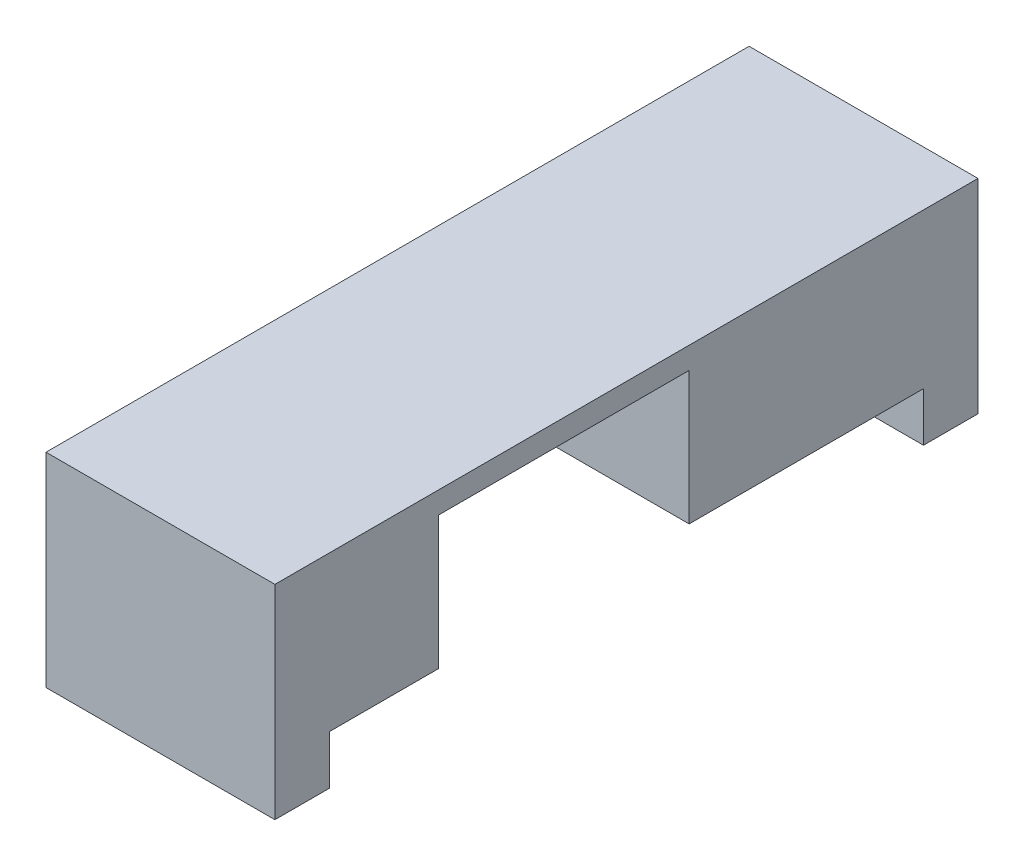
ISO-10303-21;
HEADER;
FILE_DESCRIPTION(('STEP AP214'),'2;1');
FILE_NAME('part.step','',(''),(''),'','','');
FILE_SCHEMA(('AUTOMOTIVE_DESIGN { 1 0 10303 214 1 1 1 1 }'));
ENDSEC;
DATA;
#1=APPLICATION_CONTEXT('core data for automotive mechanical design processes');
#2=APPLICATION_PROTOCOL_DEFINITION('international standard','automotive_design',2000,#1);
#3=PRODUCT_CONTEXT('',#1,'mechanical');
#4=PRODUCT('Part','Part','',(#3));
#5=PRODUCT_RELATED_PRODUCT_CATEGORY('part','',(#4));
#6=PRODUCT_DEFINITION_FORMATION('','',#4);
#7=PRODUCT_DEFINITION_CONTEXT('part definition',#1,'design');
#8=PRODUCT_DEFINITION('design','',#6,#7);
#9=PRODUCT_DEFINITION_SHAPE('','',#8);
#10=(LENGTH_UNIT() NAMED_UNIT(*) SI_UNIT(.MILLI.,.METRE.));
#11=(NAMED_UNIT(*) PLANE_ANGLE_UNIT() SI_UNIT($,.RADIAN.));
#12=(NAMED_UNIT(*) SI_UNIT($,.STERADIAN.) SOLID_ANGLE_UNIT());
#13=UNCERTAINTY_MEASURE_WITH_UNIT(LENGTH_MEASURE(1.E-05),#10,'distance_accuracy_value','');
#14=(GEOMETRIC_REPRESENTATION_CONTEXT(3) GLOBAL_UNCERTAINTY_ASSIGNED_CONTEXT((#13)) GLOBAL_UNIT_ASSIGNED_CONTEXT((#10,
#11,#12)) REPRESENTATION_CONTEXT('',''));
#15=CARTESIAN_POINT('',(0.,0.,0.));
#16=DIRECTION('',(0.,0.,1.));
#17=DIRECTION('',(1.,0.,0.));
#18=AXIS2_PLACEMENT_3D('',#15,#16,#17);
#19=CARTESIAN_POINT('',(-21.,0.,59.5));
#20=DIRECTION('',(0.,0.,1.));
#21=DIRECTION('',(1.,0.,0.));
#22=AXIS2_PLACEMENT_3D('',#19,#20,#21);
#23=PLANE('',#22);
#24=DIRECTION('',(1.,0.,0.));
#25=VECTOR('',#24,1.);
#26=CARTESIAN_POINT('',(-21.,0.,59.5));
#27=LINE('',#26,#25);
#28=CARTESIAN_POINT('',(-12.3,0.,59.5));
#29=VERTEX_POINT('',#28);
#30=CARTESIAN_POINT('',(0.,0.,59.5));
#31=VERTEX_POINT('',#30);
#32=EDGE_CURVE('E226',#29,#31,#27,.T.);
#33=ORIENTED_EDGE('',*,*,#32,.F.);
#34=DIRECTION('',(0.,-1.,0.));
#35=VECTOR('',#34,1.);
#36=CARTESIAN_POINT('',(-12.3,0.,59.5));
#37=LINE('',#36,#35);
#38=CARTESIAN_POINT('',(-12.3,4.5,59.5));
#39=VERTEX_POINT('',#38);
#40=EDGE_CURVE('E159',#39,#29,#37,.T.);
#41=ORIENTED_EDGE('',*,*,#40,.F.);
#42=DIRECTION('',(1.,0.,0.));
#43=VECTOR('',#42,1.);
#44=CARTESIAN_POINT('',(-21.,4.5,59.5));
#45=LINE('',#44,#43);
#46=CARTESIAN_POINT('',(0.,4.5,59.5));
#47=VERTEX_POINT('',#46);
#48=EDGE_CURVE('E258',#39,#47,#45,.T.);
#49=ORIENTED_EDGE('',*,*,#48,.T.);
#50=DIRECTION('',(0.,-1.,0.));
#51=VECTOR('',#50,1.);
#52=CARTESIAN_POINT('',(0.,0.,59.5));
#53=LINE('',#52,#51);
#54=EDGE_CURVE('E193',#47,#31,#53,.T.);
#55=ORIENTED_EDGE('',*,*,#54,.T.);
#56=EDGE_LOOP('',(#33,#41,#49,#55));
#57=FACE_BOUND('',#56,.T.);
#58=ADVANCED_FACE('F39',(#57),#23,.F.);
#59=CARTESIAN_POINT('',(0.,0.,0.));
#60=DIRECTION('',(0.,-1.,0.));
#61=DIRECTION('',(0.,0.,-1.));
#62=AXIS2_PLACEMENT_3D('',#59,#60,#61);
#63=PLANE('',#62);
#64=DIRECTION('',(0.,0.,-1.));
#65=VECTOR('',#64,1.);
#66=CARTESIAN_POINT('',(-12.3,0.,62.5));
#67=LINE('',#66,#65);
#68=CARTESIAN_POINT('',(-12.3,0.,62.5));
#69=VERTEX_POINT('',#68);
#70=EDGE_CURVE('E153',#69,#29,#67,.T.);
#71=ORIENTED_EDGE('',*,*,#70,.T.);
#72=ORIENTED_EDGE('',*,*,#32,.T.);
#73=DIRECTION('',(0.,0.,-1.));
#74=VECTOR('',#73,1.);
#75=CARTESIAN_POINT('',(0.,0.,0.));
#76=LINE('',#75,#74);
#77=CARTESIAN_POINT('',(0.,0.,64.5));
#78=VERTEX_POINT('',#77);
#79=EDGE_CURVE('E295',#78,#31,#76,.T.);
#80=ORIENTED_EDGE('',*,*,#79,.F.);
#81=DIRECTION('',(1.,0.,0.));
#82=VECTOR('',#81,1.);
#83=CARTESIAN_POINT('',(0.,0.,64.5));
#84=LINE('',#83,#82);
#85=CARTESIAN_POINT('',(-21.,0.,64.5));
#86=VERTEX_POINT('',#85);
#87=EDGE_CURVE('E285',#86,#78,#84,.T.);
#88=ORIENTED_EDGE('',*,*,#87,.F.);
#89=DIRECTION('',(0.,0.,1.));
#90=VECTOR('',#89,1.);
#91=CARTESIAN_POINT('',(-21.,0.,0.));
#92=LINE('',#91,#90);
#93=CARTESIAN_POINT('',(-21.,0.,59.5));
#94=VERTEX_POINT('',#93);
#95=EDGE_CURVE('E302',#94,#86,#92,.T.);
#96=ORIENTED_EDGE('',*,*,#95,.F.);
#97=CARTESIAN_POINT('',(-15.5,0.,59.5));
#98=VERTEX_POINT('',#97);
#99=EDGE_CURVE('E277',#94,#98,#27,.T.);
#100=ORIENTED_EDGE('',*,*,#99,.T.);
#101=DIRECTION('',(0.,0.,-1.));
#102=VECTOR('',#101,1.);
#103=CARTESIAN_POINT('',(-15.5,0.,62.5));
#104=LINE('',#103,#102);
#105=CARTESIAN_POINT('',(-15.5,0.,62.5));
#106=VERTEX_POINT('',#105);
#107=EDGE_CURVE('E164',#106,#98,#104,.T.);
#108=ORIENTED_EDGE('',*,*,#107,.F.);
#109=DIRECTION('',(-1.,0.,0.));
#110=VECTOR('',#109,1.);
#111=CARTESIAN_POINT('',(-12.3,0.,62.5));
#112=LINE('',#111,#110);
#113=EDGE_CURVE('E171',#69,#106,#112,.T.);
#114=ORIENTED_EDGE('',*,*,#113,.F.);
#115=EDGE_LOOP('',(#71,#72,#80,#88,#96,#100,#108,#114));
#116=FACE_BOUND('',#115,.T.);
#117=ADVANCED_FACE('F176',(#116),#63,.T.);
#118=CARTESIAN_POINT('',(0.,18.7,0.));
#119=DIRECTION('',(-1.,0.,0.));
#120=DIRECTION('',(0.,0.,1.));
#121=AXIS2_PLACEMENT_3D('',#118,#119,#120);
#122=PLANE('',#121);
#123=ORIENTED_EDGE('',*,*,#79,.T.);
#124=ORIENTED_EDGE('',*,*,#54,.F.);
#125=DIRECTION('',(0.,0.,1.));
#126=VECTOR('',#125,1.);
#127=CARTESIAN_POINT('',(0.,4.5,59.5));
#128=LINE('',#127,#126);
#129=CARTESIAN_POINT('',(0.,4.5,49.5));
#130=VERTEX_POINT('',#129);
#131=EDGE_CURVE('E203',#130,#47,#128,.T.);
#132=ORIENTED_EDGE('',*,*,#131,.F.);
#133=DIRECTION('',(0.,-1.,0.));
#134=VECTOR('',#133,1.);
#135=CARTESIAN_POINT('',(0.,4.5,49.5));
#136=LINE('',#135,#134);
#137=CARTESIAN_POINT('',(0.,16.7,49.5));
#138=VERTEX_POINT('',#137);
#139=EDGE_CURVE('E246',#138,#130,#136,.T.);
#140=ORIENTED_EDGE('',*,*,#139,.F.);
#141=DIRECTION('',(0.,0.,1.));
#142=VECTOR('',#141,1.);
#143=CARTESIAN_POINT('',(0.,16.7,49.5));
#144=LINE('',#143,#142);
#145=CARTESIAN_POINT('',(0.,16.7,26.5));
#146=VERTEX_POINT('',#145);
#147=EDGE_CURVE('E242',#146,#138,#144,.T.);
#148=ORIENTED_EDGE('',*,*,#147,.F.);
#149=DIRECTION('',(0.,1.,0.));
#150=VECTOR('',#149,1.);
#151=CARTESIAN_POINT('',(0.,4.5,26.5));
#152=LINE('',#151,#150);
#153=CARTESIAN_POINT('',(0.,4.5,26.5));
#154=VERTEX_POINT('',#153);
#155=EDGE_CURVE('E238',#154,#146,#152,.T.);
#156=ORIENTED_EDGE('',*,*,#155,.F.);
#157=DIRECTION('',(0.,0.,1.));
#158=VECTOR('',#157,1.);
#159=CARTESIAN_POINT('',(0.,4.5,26.5));
#160=LINE('',#159,#158);
#161=CARTESIAN_POINT('',(0.,4.5,5.));
#162=VERTEX_POINT('',#161);
#163=EDGE_CURVE('E234',#162,#154,#160,.T.);
#164=ORIENTED_EDGE('',*,*,#163,.F.);
#165=DIRECTION('',(0.,1.,0.));
#166=VECTOR('',#165,1.);
#167=CARTESIAN_POINT('',(0.,0.,5.));
#168=LINE('',#167,#166);
#169=CARTESIAN_POINT('',(0.,0.,5.));
#170=VERTEX_POINT('',#169);
#171=EDGE_CURVE('E230',#170,#162,#168,.T.);
#172=ORIENTED_EDGE('',*,*,#171,.F.);
#173=CARTESIAN_POINT('',(0.,0.,0.));
#174=VERTEX_POINT('',#173);
#175=EDGE_CURVE('E257',#170,#174,#76,.T.);
#176=ORIENTED_EDGE('',*,*,#175,.T.);
#177=DIRECTION('',(0.,-1.,0.));
#178=VECTOR('',#177,1.);
#179=CARTESIAN_POINT('',(0.,18.7,0.));
#180=LINE('',#179,#178);
#181=CARTESIAN_POINT('',(0.,18.7,0.));
#182=VERTEX_POINT('',#181);
#183=EDGE_CURVE('E11',#182,#174,#180,.T.);
#184=ORIENTED_EDGE('',*,*,#183,.F.);
#185=DIRECTION('',(0.,0.,-1.));
#186=VECTOR('',#185,1.);
#187=CARTESIAN_POINT('',(0.,18.7,0.));
#188=LINE('',#187,#186);
#189=CARTESIAN_POINT('',(0.,18.7,64.5));
#190=VERTEX_POINT('',#189);
#191=EDGE_CURVE('E280',#190,#182,#188,.T.);
#192=ORIENTED_EDGE('',*,*,#191,.F.);
#193=DIRECTION('',(0.,-1.,0.));
#194=VECTOR('',#193,1.);
#195=CARTESIAN_POINT('',(0.,18.7,64.5));
#196=LINE('',#195,#194);
#197=EDGE_CURVE('E294',#190,#78,#196,.T.);
#198=ORIENTED_EDGE('',*,*,#197,.T.);
#199=EDGE_LOOP('',(#123,#124,#132,#140,#148,#156,#164,#172,#176,#184,#192,#198));
#200=FACE_BOUND('',#199,.T.);
#201=ADVANCED_FACE('F41',(#200),#122,.F.);
#202=CARTESIAN_POINT('',(0.,18.7,0.));
#203=DIRECTION('',(0.,0.,1.));
#204=DIRECTION('',(1.,0.,0.));
#205=AXIS2_PLACEMENT_3D('',#202,#203,#204);
#206=PLANE('',#205);
#207=DIRECTION('',(-1.,0.,0.));
#208=VECTOR('',#207,1.);
#209=CARTESIAN_POINT('',(0.,0.,0.));
#210=LINE('',#209,#208);
#211=CARTESIAN_POINT('',(-21.,0.,0.));
#212=VERTEX_POINT('',#211);
#213=EDGE_CURVE('E299',#174,#212,#210,.T.);
#214=ORIENTED_EDGE('',*,*,#213,.T.);
#215=DIRECTION('',(0.,-1.,0.));
#216=VECTOR('',#215,1.);
#217=CARTESIAN_POINT('',(-21.,18.7,0.));
#218=LINE('',#217,#216);
#219=CARTESIAN_POINT('',(-21.,18.7,0.));
#220=VERTEX_POINT('',#219);
#221=EDGE_CURVE('E48',#220,#212,#218,.T.);
#222=ORIENTED_EDGE('',*,*,#221,.F.);
#223=DIRECTION('',(-1.,0.,0.));
#224=VECTOR('',#223,1.);
#225=CARTESIAN_POINT('',(0.,18.7,0.));
#226=LINE('',#225,#224);
#227=EDGE_CURVE('E284',#182,#220,#226,.T.);
#228=ORIENTED_EDGE('',*,*,#227,.F.);
#229=ORIENTED_EDGE('',*,*,#183,.T.);
#230=EDGE_LOOP('',(#214,#222,#228,#229));
#231=FACE_BOUND('',#230,.T.);
#232=ADVANCED_FACE('F372',(#231),#206,.F.);
#233=CARTESIAN_POINT('',(-21.,18.7,0.));
#234=DIRECTION('',(1.,0.,0.));
#235=DIRECTION('',(0.,0.,-1.));
#236=AXIS2_PLACEMENT_3D('',#233,#234,#235);
#237=PLANE('',#236);
#238=DIRECTION('',(0.,0.,1.));
#239=VECTOR('',#238,1.);
#240=CARTESIAN_POINT('',(-21.,4.5,59.5));
#241=LINE('',#240,#239);
#242=CARTESIAN_POINT('',(-21.,4.5,49.5));
#243=VERTEX_POINT('',#242);
#244=CARTESIAN_POINT('',(-21.,4.5,59.5));
#245=VERTEX_POINT('',#244);
#246=EDGE_CURVE('E222',#243,#245,#241,.T.);
#247=ORIENTED_EDGE('',*,*,#246,.T.);
#248=DIRECTION('',(0.,-1.,0.));
#249=VECTOR('',#248,1.);
#250=CARTESIAN_POINT('',(-21.,0.,59.5));
#251=LINE('',#250,#249);
#252=EDGE_CURVE('E199',#245,#94,#251,.T.);
#253=ORIENTED_EDGE('',*,*,#252,.T.);
#254=ORIENTED_EDGE('',*,*,#95,.T.);
#255=DIRECTION('',(0.,-1.,0.));
#256=VECTOR('',#255,1.);
#257=CARTESIAN_POINT('',(-21.,18.7,64.5));
#258=LINE('',#257,#256);
#259=CARTESIAN_POINT('',(-21.,18.7,64.5));
#260=VERTEX_POINT('',#259);
#261=EDGE_CURVE('E312',#260,#86,#258,.T.);
#262=ORIENTED_EDGE('',*,*,#261,.F.);
#263=DIRECTION('',(0.,0.,1.));
#264=VECTOR('',#263,1.);
#265=CARTESIAN_POINT('',(-21.,18.7,0.));
#266=LINE('',#265,#264);
#267=EDGE_CURVE('E288',#220,#260,#266,.T.);
#268=ORIENTED_EDGE('',*,*,#267,.F.);
#269=ORIENTED_EDGE('',*,*,#221,.T.);
#270=CARTESIAN_POINT('',(-21.,0.,5.));
#271=VERTEX_POINT('',#270);
#272=EDGE_CURVE('E303',#212,#271,#92,.T.);
#273=ORIENTED_EDGE('',*,*,#272,.T.);
#274=DIRECTION('',(0.,1.,0.));
#275=VECTOR('',#274,1.);
#276=CARTESIAN_POINT('',(-21.,0.,5.));
#277=LINE('',#276,#275);
#278=CARTESIAN_POINT('',(-21.,4.5,5.));
#279=VERTEX_POINT('',#278);
#280=EDGE_CURVE('E63',#271,#279,#277,.T.);
#281=ORIENTED_EDGE('',*,*,#280,.T.);
#282=DIRECTION('',(0.,0.,1.));
#283=VECTOR('',#282,1.);
#284=CARTESIAN_POINT('',(-21.,4.5,26.5));
#285=LINE('',#284,#283);
#286=CARTESIAN_POINT('',(-21.,4.5,26.5));
#287=VERTEX_POINT('',#286);
#288=EDGE_CURVE('E206',#279,#287,#285,.T.);
#289=ORIENTED_EDGE('',*,*,#288,.T.);
#290=DIRECTION('',(0.,1.,0.));
#291=VECTOR('',#290,1.);
#292=CARTESIAN_POINT('',(-21.,4.5,26.5));
#293=LINE('',#292,#291);
#294=CARTESIAN_POINT('',(-21.,16.7,26.5));
#295=VERTEX_POINT('',#294);
#296=EDGE_CURVE('E210',#287,#295,#293,.T.);
#297=ORIENTED_EDGE('',*,*,#296,.T.);
#298=DIRECTION('',(0.,0.,1.));
#299=VECTOR('',#298,1.);
#300=CARTESIAN_POINT('',(-21.,16.7,49.5));
#301=LINE('',#300,#299);
#302=CARTESIAN_POINT('',(-21.,16.7,49.5));
#303=VERTEX_POINT('',#302);
#304=EDGE_CURVE('E214',#295,#303,#301,.T.);
#305=ORIENTED_EDGE('',*,*,#304,.T.);
#306=DIRECTION('',(0.,-1.,0.));
#307=VECTOR('',#306,1.);
#308=CARTESIAN_POINT('',(-21.,4.5,49.5));
#309=LINE('',#308,#307);
#310=EDGE_CURVE('E218',#303,#243,#309,.T.);
#311=ORIENTED_EDGE('',*,*,#310,.T.);
#312=EDGE_LOOP('',(#247,#253,#254,#262,#268,#269,#273,#281,#289,#297,#305,#311));
#313=FACE_BOUND('',#312,.T.);
#314=ADVANCED_FACE('F321',(#313),#237,.F.);
#315=CARTESIAN_POINT('',(0.,18.7,64.5));
#316=DIRECTION('',(0.,0.,-1.));
#317=DIRECTION('',(-1.,0.,0.));
#318=AXIS2_PLACEMENT_3D('',#315,#316,#317);
#319=PLANE('',#318);
#320=ORIENTED_EDGE('',*,*,#87,.T.);
#321=ORIENTED_EDGE('',*,*,#197,.F.);
#322=DIRECTION('',(1.,0.,0.));
#323=VECTOR('',#322,1.);
#324=CARTESIAN_POINT('',(0.,18.7,64.5));
#325=LINE('',#324,#323);
#326=EDGE_CURVE('E291',#260,#190,#325,.T.);
#327=ORIENTED_EDGE('',*,*,#326,.F.);
#328=ORIENTED_EDGE('',*,*,#261,.T.);
#329=EDGE_LOOP('',(#320,#321,#327,#328));
#330=FACE_BOUND('',#329,.T.);
#331=ADVANCED_FACE('F369',(#330),#319,.F.);
#332=CARTESIAN_POINT('',(0.,18.7,0.));
#333=DIRECTION('',(0.,-1.,0.));
#334=DIRECTION('',(0.,0.,-1.));
#335=AXIS2_PLACEMENT_3D('',#332,#333,#334);
#336=PLANE('',#335);
#337=ORIENTED_EDGE('',*,*,#191,.T.);
#338=ORIENTED_EDGE('',*,*,#227,.T.);
#339=ORIENTED_EDGE('',*,*,#267,.T.);
#340=ORIENTED_EDGE('',*,*,#326,.T.);
#341=EDGE_LOOP('',(#337,#338,#339,#340));
#342=FACE_BOUND('',#341,.T.);
#343=ADVANCED_FACE('F371',(#342),#336,.F.);
#344=DIRECTION('',(1.,0.,0.));
#345=VECTOR('',#344,1.);
#346=CARTESIAN_POINT('',(-21.,0.,5.));
#347=LINE('',#346,#345);
#348=EDGE_CURVE('E274',#271,#170,#347,.T.);
#349=ORIENTED_EDGE('',*,*,#348,.F.);
#350=ORIENTED_EDGE('',*,*,#272,.F.);
#351=ORIENTED_EDGE('',*,*,#213,.F.);
#352=ORIENTED_EDGE('',*,*,#175,.F.);
#353=EDGE_LOOP('',(#349,#350,#351,#352));
#354=FACE_BOUND('',#353,.T.);
#355=ADVANCED_FACE('F326',(#354),#63,.T.);
#356=CARTESIAN_POINT('',(-15.5,4.5,59.5));
#357=VERTEX_POINT('',#356);
#358=EDGE_CURVE('E253',#245,#357,#45,.T.);
#359=ORIENTED_EDGE('',*,*,#358,.T.);
#360=DIRECTION('',(0.,1.,0.));
#361=VECTOR('',#360,1.);
#362=CARTESIAN_POINT('',(-15.5,0.,59.5));
#363=LINE('',#362,#361);
#364=EDGE_CURVE('E55',#98,#357,#363,.T.);
#365=ORIENTED_EDGE('',*,*,#364,.F.);
#366=ORIENTED_EDGE('',*,*,#99,.F.);
#367=ORIENTED_EDGE('',*,*,#252,.F.);
#368=EDGE_LOOP('',(#359,#365,#366,#367));
#369=FACE_BOUND('',#368,.T.);
#370=ADVANCED_FACE('F354',(#369),#23,.F.);
#371=CARTESIAN_POINT('',(-21.,4.5,59.5));
#372=DIRECTION('',(0.,1.,0.));
#373=DIRECTION('',(0.,0.,1.));
#374=AXIS2_PLACEMENT_3D('',#371,#372,#373);
#375=PLANE('',#374);
#376=ORIENTED_EDGE('',*,*,#131,.T.);
#377=ORIENTED_EDGE('',*,*,#48,.F.);
#378=DIRECTION('',(0.,0.,-1.));
#379=VECTOR('',#378,1.);
#380=CARTESIAN_POINT('',(-12.3,4.5,62.5));
#381=LINE('',#380,#379);
#382=CARTESIAN_POINT('',(-12.3,4.5,62.5));
#383=VERTEX_POINT('',#382);
#384=EDGE_CURVE('E190',#383,#39,#381,.T.);
#385=ORIENTED_EDGE('',*,*,#384,.F.);
#386=DIRECTION('',(1.,0.,0.));
#387=VECTOR('',#386,1.);
#388=CARTESIAN_POINT('',(-12.3,4.5,62.5));
#389=LINE('',#388,#387);
#390=CARTESIAN_POINT('',(-15.5,4.5,62.5));
#391=VERTEX_POINT('',#390);
#392=EDGE_CURVE('E165',#391,#383,#389,.T.);
#393=ORIENTED_EDGE('',*,*,#392,.F.);
#394=DIRECTION('',(0.,0.,-1.));
#395=VECTOR('',#394,1.);
#396=CARTESIAN_POINT('',(-15.5,4.5,62.5));
#397=LINE('',#396,#395);
#398=EDGE_CURVE('E194',#391,#357,#397,.T.);
#399=ORIENTED_EDGE('',*,*,#398,.T.);
#400=ORIENTED_EDGE('',*,*,#358,.F.);
#401=ORIENTED_EDGE('',*,*,#246,.F.);
#402=DIRECTION('',(1.,0.,0.));
#403=VECTOR('',#402,1.);
#404=CARTESIAN_POINT('',(-21.,4.5,49.5));
#405=LINE('',#404,#403);
#406=EDGE_CURVE('E259',#243,#130,#405,.T.);
#407=ORIENTED_EDGE('',*,*,#406,.T.);
#408=EDGE_LOOP('',(#376,#377,#385,#393,#399,#400,#401,#407));
#409=FACE_BOUND('',#408,.T.);
#410=ADVANCED_FACE('F352',(#409),#375,.F.);
#411=CARTESIAN_POINT('',(-21.,4.5,49.5));
#412=DIRECTION('',(0.,0.,1.));
#413=DIRECTION('',(1.,0.,0.));
#414=AXIS2_PLACEMENT_3D('',#411,#412,#413);
#415=PLANE('',#414);
#416=ORIENTED_EDGE('',*,*,#139,.T.);
#417=ORIENTED_EDGE('',*,*,#406,.F.);
#418=ORIENTED_EDGE('',*,*,#310,.F.);
#419=DIRECTION('',(1.,0.,0.));
#420=VECTOR('',#419,1.);
#421=CARTESIAN_POINT('',(-21.,16.7,49.5));
#422=LINE('',#421,#420);
#423=EDGE_CURVE('E262',#303,#138,#422,.T.);
#424=ORIENTED_EDGE('',*,*,#423,.T.);
#425=EDGE_LOOP('',(#416,#417,#418,#424));
#426=FACE_BOUND('',#425,.T.);
#427=ADVANCED_FACE('F347',(#426),#415,.F.);
#428=CARTESIAN_POINT('',(-21.,16.7,49.5));
#429=DIRECTION('',(0.,1.,0.));
#430=DIRECTION('',(0.,0.,1.));
#431=AXIS2_PLACEMENT_3D('',#428,#429,#430);
#432=PLANE('',#431);
#433=ORIENTED_EDGE('',*,*,#147,.T.);
#434=ORIENTED_EDGE('',*,*,#423,.F.);
#435=ORIENTED_EDGE('',*,*,#304,.F.);
#436=DIRECTION('',(1.,0.,0.));
#437=VECTOR('',#436,1.);
#438=CARTESIAN_POINT('',(-21.,16.7,26.5));
#439=LINE('',#438,#437);
#440=EDGE_CURVE('E265',#295,#146,#439,.T.);
#441=ORIENTED_EDGE('',*,*,#440,.T.);
#442=EDGE_LOOP('',(#433,#434,#435,#441));
#443=FACE_BOUND('',#442,.T.);
#444=ADVANCED_FACE('F343',(#443),#432,.F.);
#445=CARTESIAN_POINT('',(-21.,4.5,26.5));
#446=DIRECTION('',(0.,0.,-1.));
#447=DIRECTION('',(-1.,0.,0.));
#448=AXIS2_PLACEMENT_3D('',#445,#446,#447);
#449=PLANE('',#448);
#450=ORIENTED_EDGE('',*,*,#155,.T.);
#451=ORIENTED_EDGE('',*,*,#440,.F.);
#452=ORIENTED_EDGE('',*,*,#296,.F.);
#453=DIRECTION('',(1.,0.,0.));
#454=VECTOR('',#453,1.);
#455=CARTESIAN_POINT('',(-21.,4.5,26.5));
#456=LINE('',#455,#454);
#457=EDGE_CURVE('E268',#287,#154,#456,.T.);
#458=ORIENTED_EDGE('',*,*,#457,.T.);
#459=EDGE_LOOP('',(#450,#451,#452,#458));
#460=FACE_BOUND('',#459,.T.);
#461=ADVANCED_FACE('F341',(#460),#449,.F.);
#462=CARTESIAN_POINT('',(-21.,4.5,26.5));
#463=DIRECTION('',(0.,1.,0.));
#464=DIRECTION('',(0.,0.,1.));
#465=AXIS2_PLACEMENT_3D('',#462,#463,#464);
#466=PLANE('',#465);
#467=ORIENTED_EDGE('',*,*,#163,.T.);
#468=ORIENTED_EDGE('',*,*,#457,.F.);
#469=ORIENTED_EDGE('',*,*,#288,.F.);
#470=DIRECTION('',(1.,0.,0.));
#471=VECTOR('',#470,1.);
#472=CARTESIAN_POINT('',(-21.,4.5,5.));
#473=LINE('',#472,#471);
#474=EDGE_CURVE('E271',#279,#162,#473,.T.);
#475=ORIENTED_EDGE('',*,*,#474,.T.);
#476=EDGE_LOOP('',(#467,#468,#469,#475));
#477=FACE_BOUND('',#476,.T.);
#478=ADVANCED_FACE('F336',(#477),#466,.F.);
#479=CARTESIAN_POINT('',(-21.,0.,5.));
#480=DIRECTION('',(0.,0.,-1.));
#481=DIRECTION('',(0.,1.,0.));
#482=AXIS2_PLACEMENT_3D('',#479,#480,#481);
#483=PLANE('',#482);
#484=ORIENTED_EDGE('',*,*,#171,.T.);
#485=ORIENTED_EDGE('',*,*,#474,.F.);
#486=ORIENTED_EDGE('',*,*,#280,.F.);
#487=ORIENTED_EDGE('',*,*,#348,.T.);
#488=EDGE_LOOP('',(#484,#485,#486,#487));
#489=FACE_BOUND('',#488,.T.);
#490=ADVANCED_FACE('F329',(#489),#483,.F.);
#491=CARTESIAN_POINT('',(-12.3,0.,62.5));
#492=DIRECTION('',(1.,0.,0.));
#493=DIRECTION('',(0.,0.,-1.));
#494=AXIS2_PLACEMENT_3D('',#491,#492,#493);
#495=PLANE('',#494);
#496=ORIENTED_EDGE('',*,*,#40,.T.);
#497=ORIENTED_EDGE('',*,*,#70,.F.);
#498=DIRECTION('',(0.,-1.,0.));
#499=VECTOR('',#498,1.);
#500=CARTESIAN_POINT('',(-12.3,0.,62.5));
#501=LINE('',#500,#499);
#502=EDGE_CURVE('E156',#383,#69,#501,.T.);
#503=ORIENTED_EDGE('',*,*,#502,.F.);
#504=ORIENTED_EDGE('',*,*,#384,.T.);
#505=EDGE_LOOP('',(#496,#497,#503,#504));
#506=FACE_BOUND('',#505,.T.);
#507=ADVANCED_FACE('F155',(#506),#495,.F.);
#508=CARTESIAN_POINT('',(-15.5,0.,62.5));
#509=DIRECTION('',(-1.,0.,0.));
#510=DIRECTION('',(0.,0.,1.));
#511=AXIS2_PLACEMENT_3D('',#508,#509,#510);
#512=PLANE('',#511);
#513=ORIENTED_EDGE('',*,*,#364,.T.);
#514=ORIENTED_EDGE('',*,*,#398,.F.);
#515=DIRECTION('',(0.,1.,0.));
#516=VECTOR('',#515,1.);
#517=CARTESIAN_POINT('',(-15.5,0.,62.5));
#518=LINE('',#517,#516);
#519=EDGE_CURVE('E179',#106,#391,#518,.T.);
#520=ORIENTED_EDGE('',*,*,#519,.F.);
#521=ORIENTED_EDGE('',*,*,#107,.T.);
#522=EDGE_LOOP('',(#513,#514,#520,#521));
#523=FACE_BOUND('',#522,.T.);
#524=ADVANCED_FACE('F490',(#523),#512,.F.);
#525=CARTESIAN_POINT('',(0.,0.,62.5));
#526=DIRECTION('',(0.,0.,1.));
#527=DIRECTION('',(1.,0.,0.));
#528=AXIS2_PLACEMENT_3D('',#525,#526,#527);
#529=PLANE('',#528);
#530=ORIENTED_EDGE('',*,*,#502,.T.);
#531=ORIENTED_EDGE('',*,*,#113,.T.);
#532=ORIENTED_EDGE('',*,*,#519,.T.);
#533=ORIENTED_EDGE('',*,*,#392,.T.);
#534=EDGE_LOOP('',(#530,#531,#532,#533));
#535=FACE_BOUND('',#534,.T.);
#536=ADVANCED_FACE('F169',(#535),#529,.F.);
#537=CLOSED_SHELL('',(#58,#117,#201,#232,#314,#331,#343,#355,#370,#410,#427,#444,#461,#478,#490,
#507,#524,#536));
#538=MANIFOLD_SOLID_BREP('B2',#537);
#539=ADVANCED_BREP_SHAPE_REPRESENTATION('',(#18,#538),#14);
#540=SHAPE_DEFINITION_REPRESENTATION(#9,#539);
ENDSEC;
END-ISO-10303-21;
